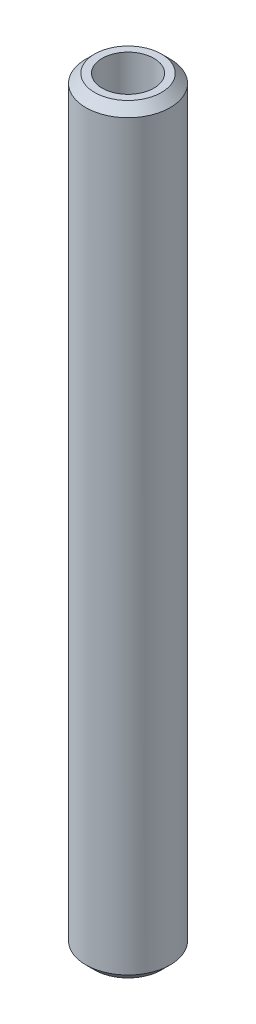
ISO-10303-21;
HEADER;
FILE_DESCRIPTION(('STEP AP214'),'2;1');
FILE_NAME('part.step','',(''),(''),'','','');
FILE_SCHEMA(('AUTOMOTIVE_DESIGN { 1 0 10303 214 1 1 1 1 }'));
ENDSEC;
DATA;
#1=APPLICATION_CONTEXT('core data for automotive mechanical design processes');
#2=APPLICATION_PROTOCOL_DEFINITION('international standard','automotive_design',2000,#1);
#3=PRODUCT_CONTEXT('',#1,'mechanical');
#4=PRODUCT('Part','Part','',(#3));
#5=PRODUCT_RELATED_PRODUCT_CATEGORY('part','',(#4));
#6=PRODUCT_DEFINITION_FORMATION('','',#4);
#7=PRODUCT_DEFINITION_CONTEXT('part definition',#1,'design');
#8=PRODUCT_DEFINITION('design','',#6,#7);
#9=PRODUCT_DEFINITION_SHAPE('','',#8);
#10=(LENGTH_UNIT() NAMED_UNIT(*) SI_UNIT(.MILLI.,.METRE.));
#11=(NAMED_UNIT(*) PLANE_ANGLE_UNIT() SI_UNIT($,.RADIAN.));
#12=(NAMED_UNIT(*) SI_UNIT($,.STERADIAN.) SOLID_ANGLE_UNIT());
#13=UNCERTAINTY_MEASURE_WITH_UNIT(LENGTH_MEASURE(1.E-05),#10,'distance_accuracy_value','');
#14=(GEOMETRIC_REPRESENTATION_CONTEXT(3) GLOBAL_UNCERTAINTY_ASSIGNED_CONTEXT((#13)) GLOBAL_UNIT_ASSIGNED_CONTEXT((#10,
#11,#12)) REPRESENTATION_CONTEXT('',''));
#15=CARTESIAN_POINT('',(0.,0.,0.));
#16=DIRECTION('',(0.,0.,1.));
#17=DIRECTION('',(1.,0.,0.));
#18=AXIS2_PLACEMENT_3D('',#15,#16,#17);
#19=CARTESIAN_POINT('',(0.,495.99092039349,0.));
#20=DIRECTION('',(0.,-1.,0.));
#21=DIRECTION('',(0.,0.,-1.));
#22=AXIS2_PLACEMENT_3D('',#19,#20,#21);
#23=CYLINDRICAL_SURFACE('',#22,27.5);
#24=CARTESIAN_POINT('',(0.,490.278727515379,0.));
#25=DIRECTION('',(0.,1.,0.));
#26=DIRECTION('',(0.,0.,1.));
#27=AXIS2_PLACEMENT_3D('',#24,#25,#26);
#28=CIRCLE('',#27,27.5);
#29=CARTESIAN_POINT('',(0.,490.278727515379,-27.5));
#30=VERTEX_POINT('',#29);
#31=EDGE_CURVE('E50',#30,#30,#28,.F.);
#32=ORIENTED_EDGE('',*,*,#31,.T.);
#33=EDGE_LOOP('',(#32));
#34=FACE_BOUND('',#33,.T.);
#35=CARTESIAN_POINT('',(0.,5.71219287811098,0.));
#36=DIRECTION('',(0.,1.,0.));
#37=DIRECTION('',(0.,0.,1.));
#38=AXIS2_PLACEMENT_3D('',#35,#36,#37);
#39=CIRCLE('',#38,27.5);
#40=CARTESIAN_POINT('',(0.,5.71219287811098,27.5));
#41=VERTEX_POINT('',#40);
#42=EDGE_CURVE('E51',#41,#41,#39,.T.);
#43=ORIENTED_EDGE('',*,*,#42,.T.);
#44=EDGE_LOOP('',(#43));
#45=FACE_BOUND('',#44,.T.);
#46=ADVANCED_FACE('F39',(#34,#45),#23,.T.);
#47=CARTESIAN_POINT('',(0.,495.99092039349,0.));
#48=DIRECTION('',(0.,1.,0.));
#49=DIRECTION('',(0.,0.,1.));
#50=AXIS2_PLACEMENT_3D('',#47,#48,#49);
#51=PLANE('',#50);
#52=CARTESIAN_POINT('',(0.,495.99092039349,0.));
#53=DIRECTION('',(0.,1.,0.));
#54=DIRECTION('',(0.,0.,1.));
#55=AXIS2_PLACEMENT_3D('',#52,#53,#54);
#56=CIRCLE('',#55,21.787807121889);
#57=CARTESIAN_POINT('',(0.,495.99092039349,-21.787807121889));
#58=VERTEX_POINT('',#57);
#59=EDGE_CURVE('E54',#58,#58,#56,.T.);
#60=ORIENTED_EDGE('',*,*,#59,.T.);
#61=EDGE_LOOP('',(#60));
#62=FACE_BOUND('',#61,.T.);
#63=CARTESIAN_POINT('',(0.,495.99092039349,0.));
#64=DIRECTION('',(0.,1.,0.));
#65=DIRECTION('',(0.,0.,1.));
#66=AXIS2_PLACEMENT_3D('',#63,#64,#65);
#67=CIRCLE('',#66,16.889396059873);
#68=CARTESIAN_POINT('',(0.,495.99092039349,16.889396059873));
#69=VERTEX_POINT('',#68);
#70=EDGE_CURVE('E58',#69,#69,#67,.T.);
#71=ORIENTED_EDGE('',*,*,#70,.F.);
#72=EDGE_LOOP('',(#71));
#73=FACE_BOUND('',#72,.T.);
#74=ADVANCED_FACE('F69',(#62,#73),#51,.T.);
#75=CARTESIAN_POINT('',(0.,0.,0.));
#76=DIRECTION('',(0.,1.,0.));
#77=DIRECTION('',(0.,0.,1.));
#78=AXIS2_PLACEMENT_3D('',#75,#76,#77);
#79=PLANE('',#78);
#80=CARTESIAN_POINT('',(0.,0.,0.));
#81=DIRECTION('',(0.,1.,0.));
#82=DIRECTION('',(0.,0.,1.));
#83=AXIS2_PLACEMENT_3D('',#80,#81,#82);
#84=CIRCLE('',#83,21.787807121889);
#85=CARTESIAN_POINT('',(0.,0.,21.787807121889));
#86=VERTEX_POINT('',#85);
#87=EDGE_CURVE('E10',#86,#86,#84,.F.);
#88=ORIENTED_EDGE('',*,*,#87,.T.);
#89=EDGE_LOOP('',(#88));
#90=FACE_BOUND('',#89,.T.);
#91=CARTESIAN_POINT('',(0.,0.,0.));
#92=DIRECTION('',(0.,1.,0.));
#93=DIRECTION('',(0.,0.,1.));
#94=AXIS2_PLACEMENT_3D('',#91,#92,#93);
#95=CIRCLE('',#94,16.889396059873);
#96=CARTESIAN_POINT('',(0.,0.,16.889396059873));
#97=VERTEX_POINT('',#96);
#98=EDGE_CURVE('E63',#97,#97,#95,.T.);
#99=ORIENTED_EDGE('',*,*,#98,.T.);
#100=EDGE_LOOP('',(#99));
#101=FACE_BOUND('',#100,.T.);
#102=ADVANCED_FACE('F75',(#90,#101),#79,.F.);
#103=CARTESIAN_POINT('',(0.,495.99092039349,0.));
#104=DIRECTION('',(0.,-1.,0.));
#105=DIRECTION('',(0.,0.,-1.));
#106=AXIS2_PLACEMENT_3D('',#103,#104,#105);
#107=CYLINDRICAL_SURFACE('',#106,16.889396059873);
#108=ORIENTED_EDGE('',*,*,#70,.T.);
#109=EDGE_LOOP('',(#108));
#110=FACE_BOUND('',#109,.T.);
#111=ORIENTED_EDGE('',*,*,#98,.F.);
#112=EDGE_LOOP('',(#111));
#113=FACE_BOUND('',#112,.T.);
#114=ADVANCED_FACE('F70',(#110,#113),#107,.F.);
#115=CARTESIAN_POINT('',(0.,495.99092039349,0.));
#116=DIRECTION('',(0.,-1.,0.));
#117=DIRECTION('',(0.,0.,-1.));
#118=AXIS2_PLACEMENT_3D('',#115,#116,#117);
#119=CONICAL_SURFACE('',#118,21.787807121889,0.785398163397441);
#120=CARTESIAN_POINT('',(0.,490.278727515379,-27.5));
#121=CARTESIAN_POINT('',(0.,490.338229524526,-27.440497990853));
#122=CARTESIAN_POINT('',(0.,490.397731533673,-27.3809959817061));
#123=CARTESIAN_POINT('',(0.,490.516735551967,-27.2619919634121));
#124=CARTESIAN_POINT('',(0.,490.576237561114,-27.2024899542651));
#125=CARTESIAN_POINT('',(0.,490.695241579408,-27.0834859359711));
#126=CARTESIAN_POINT('',(0.,490.754743588555,-27.0239839268241));
#127=CARTESIAN_POINT('',(0.,490.873747606849,-26.9049799085301));
#128=CARTESIAN_POINT('',(0.,490.933249615996,-26.8454778993831));
#129=CARTESIAN_POINT('',(0.,491.05225363429,-26.7264738810892));
#130=CARTESIAN_POINT('',(0.,491.111755643437,-26.6669718719422));
#131=CARTESIAN_POINT('',(0.,491.230759661731,-26.5479678536482));
#132=CARTESIAN_POINT('',(0.,491.290261670878,-26.4884658445012));
#133=CARTESIAN_POINT('',(0.,491.409265689172,-26.3694618262072));
#134=CARTESIAN_POINT('',(0.,491.468767698319,-26.3099598170602));
#135=CARTESIAN_POINT('',(0.,491.587771716613,-26.1909557987663));
#136=CARTESIAN_POINT('',(0.,491.64727372576,-26.1314537896193));
#137=CARTESIAN_POINT('',(0.,491.766277744054,-26.0124497713253));
#138=CARTESIAN_POINT('',(0.,491.825779753201,-25.9529477621783));
#139=CARTESIAN_POINT('',(0.,491.944783771495,-25.8339437438843));
#140=CARTESIAN_POINT('',(0.,492.004285780642,-25.7744417347373));
#141=CARTESIAN_POINT('',(0.,492.123289798936,-25.6554377164433));
#142=CARTESIAN_POINT('',(0.,492.182791808083,-25.5959357072964));
#143=CARTESIAN_POINT('',(0.,492.301795826377,-25.4769316890024));
#144=CARTESIAN_POINT('',(0.,492.361297835524,-25.4174296798554));
#145=CARTESIAN_POINT('',(0.,492.480301853818,-25.2984256615614));
#146=CARTESIAN_POINT('',(0.,492.539803862965,-25.2389236524144));
#147=CARTESIAN_POINT('',(0.,492.658807881259,-25.1199196341204));
#148=CARTESIAN_POINT('',(0.,492.718309890406,-25.0604176249735));
#149=CARTESIAN_POINT('',(0.,492.8373139087,-24.9414136066795));
#150=CARTESIAN_POINT('',(0.,492.896815917846,-24.8819115975325));
#151=CARTESIAN_POINT('',(0.,493.015819936141,-24.7629075792385));
#152=CARTESIAN_POINT('',(0.,493.075321945287,-24.7034055700915));
#153=CARTESIAN_POINT('',(0.,493.194325963582,-24.5844015517975));
#154=CARTESIAN_POINT('',(0.,493.253827972728,-24.5248995426505));
#155=CARTESIAN_POINT('',(0.,493.372831991023,-24.4058955243566));
#156=CARTESIAN_POINT('',(0.,493.432334000169,-24.3463935152096));
#157=CARTESIAN_POINT('',(0.,493.551338018463,-24.2273894969156));
#158=CARTESIAN_POINT('',(0.,493.61084002761,-24.1678874877686));
#159=CARTESIAN_POINT('',(0.,493.729844045904,-24.0488834694746));
#160=CARTESIAN_POINT('',(0.,493.789346055051,-23.9893814603276));
#161=CARTESIAN_POINT('',(0.,493.908350073345,-23.8703774420337));
#162=CARTESIAN_POINT('',(0.,493.967852082492,-23.8108754328867));
#163=CARTESIAN_POINT('',(0.,494.086856100786,-23.6918714145927));
#164=CARTESIAN_POINT('',(0.,494.146358109933,-23.6323694054457));
#165=CARTESIAN_POINT('',(0.,494.265362128227,-23.5133653871517));
#166=CARTESIAN_POINT('',(0.,494.324864137374,-23.4538633780047));
#167=CARTESIAN_POINT('',(0.,494.443868155668,-23.3348593597108));
#168=CARTESIAN_POINT('',(0.,494.503370164815,-23.2753573505638));
#169=CARTESIAN_POINT('',(0.,494.622374183109,-23.1563533322698));
#170=CARTESIAN_POINT('',(0.,494.681876192256,-23.0968513231228));
#171=CARTESIAN_POINT('',(0.,494.80088021055,-22.9778473048288));
#172=CARTESIAN_POINT('',(0.,494.860382219697,-22.9183452956818));
#173=CARTESIAN_POINT('',(0.,494.979386237991,-22.7993412773878));
#174=CARTESIAN_POINT('',(0.,495.038888247138,-22.7398392682409));
#175=CARTESIAN_POINT('',(0.,495.157892265432,-22.6208352499469));
#176=CARTESIAN_POINT('',(0.,495.217394274579,-22.5613332407999));
#177=CARTESIAN_POINT('',(0.,495.336398292873,-22.4423292225059));
#178=CARTESIAN_POINT('',(0.,495.39590030202,-22.3828272133589));
#179=CARTESIAN_POINT('',(0.,495.514904320314,-22.2638231950649));
#180=CARTESIAN_POINT('',(0.,495.574406329461,-22.204321185918));
#181=CARTESIAN_POINT('',(0.,495.693410347755,-22.085317167624));
#182=CARTESIAN_POINT('',(0.,495.752912356902,-22.025815158477));
#183=CARTESIAN_POINT('',(0.,495.871916375196,-21.906811140183));
#184=CARTESIAN_POINT('',(0.,495.931418384343,-21.847309131036));
#185=CARTESIAN_POINT('',(0.,495.99092039349,-21.787807121889));
#186=B_SPLINE_CURVE_WITH_KNOTS('',3,(#120,#121,#122,#123,#124,#125,#126,#127,#128,#129,#130,
#131,#132,#133,#134,#135,#136,#137,#138,#139,#140,#141,#142,#143,#144,#145,#146,#147,#148,#149,
#150,#151,#152,#153,#154,#155,#156,#157,#158,#159,#160,#161,#162,#163,#164,#165,#166,#167,#168,
#169,#170,#171,#172,#173,#174,#175,#176,#177,#178,#179,#180,#181,#182,#183,#184,#185),
.UNSPECIFIED.,.F.,.F.,(4,2,2,2,2,2,2,2,2,2,2,2,2,2,2,2,2,2,2,2,2,2,2,2,2,2,2,2,2,2,2,2,4),(0.,
0.252445644972356,0.504891289944712,0.75733693491707,1.00978257988943,1.26222822486178,
1.51467386983418,1.76711951480654,2.01956515977889,2.27201080475125,2.52445644972361,
2.776902094696,3.02934773966836,3.28179338464072,3.53423902961307,3.78668467458543,
4.03913031955782,4.29157596453018,4.54402160950254,4.79646725447489,5.04891289944725,
5.30135854441961,5.553804189392,5.80624983436436,6.05869547933672,6.31114112430907,
6.56358676928143,6.81603241425383,7.06847805922619,7.32092370419854,7.5733693491709,
7.82581499414326,8.07826063911565),.UNSPECIFIED.);
#187=EDGE_CURVE('BSEAM81',#30,#58,#186,.T.);
#188=ORIENTED_EDGE('',*,*,#31,.F.);
#189=ORIENTED_EDGE('',*,*,#59,.F.);
#190=ORIENTED_EDGE('',*,*,#187,.T.);
#191=ORIENTED_EDGE('',*,*,#187,.F.);
#192=EDGE_LOOP('',(#188,#190,#189,#191));
#193=FACE_BOUND('',#192,.T.);
#194=ADVANCED_FACE('F81',(#193),#119,.T.);
#195=CARTESIAN_POINT('',(0.,5.71219287811098,0.));
#196=DIRECTION('',(0.,1.,0.));
#197=DIRECTION('',(0.,0.,1.));
#198=AXIS2_PLACEMENT_3D('',#195,#196,#197);
#199=CONICAL_SURFACE('',#198,27.5,0.785398163397451);
#200=ORIENTED_EDGE('',*,*,#87,.F.);
#201=EDGE_LOOP('',(#200));
#202=FACE_BOUND('',#201,.T.);
#203=ORIENTED_EDGE('',*,*,#42,.F.);
#204=EDGE_LOOP('',(#203));
#205=FACE_BOUND('',#204,.T.);
#206=ADVANCED_FACE('F45',(#202,#205),#199,.T.);
#207=CLOSED_SHELL('',(#46,#74,#102,#114,#194,#206));
#208=MANIFOLD_SOLID_BREP('B2',#207);
#209=ADVANCED_BREP_SHAPE_REPRESENTATION('',(#18,#208),#14);
#210=SHAPE_DEFINITION_REPRESENTATION(#9,#209);
ENDSEC;
END-ISO-10303-21;
